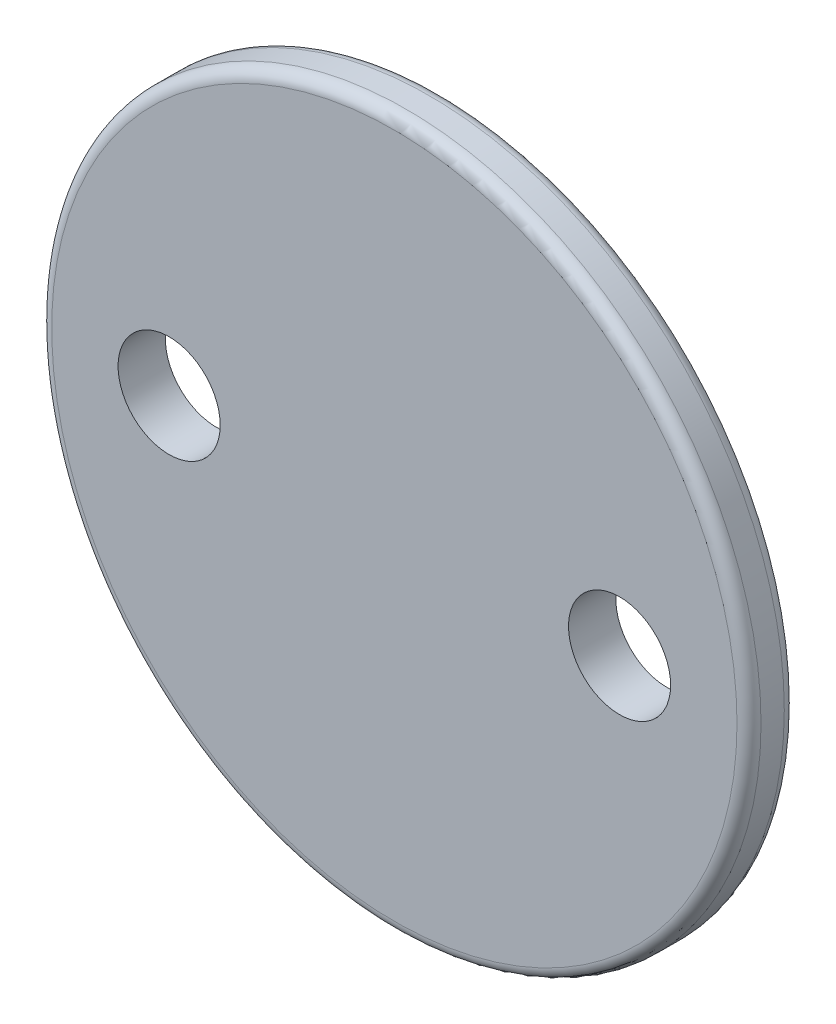
ISO-10303-21;
HEADER;
FILE_DESCRIPTION(('STEP AP214'),'2;1');
FILE_NAME('part.step','',(''),(''),'','','');
FILE_SCHEMA(('AUTOMOTIVE_DESIGN { 1 0 10303 214 1 1 1 1 }'));
ENDSEC;
DATA;
#1=APPLICATION_CONTEXT('core data for automotive mechanical design processes');
#2=APPLICATION_PROTOCOL_DEFINITION('international standard','automotive_design',2000,#1);
#3=PRODUCT_CONTEXT('',#1,'mechanical');
#4=PRODUCT('Part','Part','',(#3));
#5=PRODUCT_RELATED_PRODUCT_CATEGORY('part','',(#4));
#6=PRODUCT_DEFINITION_FORMATION('','',#4);
#7=PRODUCT_DEFINITION_CONTEXT('part definition',#1,'design');
#8=PRODUCT_DEFINITION('design','',#6,#7);
#9=PRODUCT_DEFINITION_SHAPE('','',#8);
#10=(LENGTH_UNIT() NAMED_UNIT(*) SI_UNIT(.MILLI.,.METRE.));
#11=(NAMED_UNIT(*) PLANE_ANGLE_UNIT() SI_UNIT($,.RADIAN.));
#12=(NAMED_UNIT(*) SI_UNIT($,.STERADIAN.) SOLID_ANGLE_UNIT());
#13=UNCERTAINTY_MEASURE_WITH_UNIT(LENGTH_MEASURE(1.E-05),#10,'distance_accuracy_value','');
#14=(GEOMETRIC_REPRESENTATION_CONTEXT(3) GLOBAL_UNCERTAINTY_ASSIGNED_CONTEXT((#13)) GLOBAL_UNIT_ASSIGNED_CONTEXT((#10,
#11,#12)) REPRESENTATION_CONTEXT('',''));
#15=CARTESIAN_POINT('',(0.,0.,0.));
#16=DIRECTION('',(0.,0.,1.));
#17=DIRECTION('',(1.,0.,0.));
#18=AXIS2_PLACEMENT_3D('',#15,#16,#17);
#19=CARTESIAN_POINT('',(0.,0.,0.));
#20=DIRECTION('',(0.,0.,1.));
#21=DIRECTION('',(1.,0.,0.));
#22=AXIS2_PLACEMENT_3D('',#19,#20,#21);
#23=PLANE('',#22);
#24=CARTESIAN_POINT('',(0.,0.,0.));
#25=DIRECTION('',(0.,0.,1.));
#26=DIRECTION('',(1.,0.,0.));
#27=AXIS2_PLACEMENT_3D('',#24,#25,#26);
#28=CIRCLE('',#27,4.5);
#29=CARTESIAN_POINT('',(4.5,0.,0.));
#30=VERTEX_POINT('',#29);
#31=EDGE_CURVE('E72',#30,#30,#28,.T.);
#32=ORIENTED_EDGE('',*,*,#31,.F.);
#33=EDGE_LOOP('',(#32));
#34=FACE_BOUND('',#33,.T.);
#35=CARTESIAN_POINT('',(0.,0.,0.));
#36=DIRECTION('',(0.,0.,1.));
#37=DIRECTION('',(1.,0.,0.));
#38=AXIS2_PLACEMENT_3D('',#35,#36,#37);
#39=CIRCLE('',#38,2.5);
#40=CARTESIAN_POINT('',(2.5,0.,0.));
#41=VERTEX_POINT('',#40);
#42=EDGE_CURVE('E76',#41,#41,#39,.T.);
#43=ORIENTED_EDGE('',*,*,#42,.T.);
#44=EDGE_LOOP('',(#43));
#45=FACE_BOUND('',#44,.T.);
#46=ADVANCED_FACE('F37',(#34,#45),#23,.F.);
#47=CARTESIAN_POINT('',(0.,0.,2.5));
#48=DIRECTION('',(0.,0.,-1.));
#49=DIRECTION('',(-1.,0.,0.));
#50=AXIS2_PLACEMENT_3D('',#47,#48,#49);
#51=CYLINDRICAL_SURFACE('',#50,4.5);
#52=CARTESIAN_POINT('',(0.,0.,2.5));
#53=DIRECTION('',(0.,0.,1.));
#54=DIRECTION('',(1.,0.,0.));
#55=AXIS2_PLACEMENT_3D('',#52,#53,#54);
#56=CIRCLE('',#55,4.5);
#57=CARTESIAN_POINT('',(4.5,0.,2.5));
#58=VERTEX_POINT('',#57);
#59=EDGE_CURVE('E61',#58,#58,#56,.T.);
#60=ORIENTED_EDGE('',*,*,#59,.F.);
#61=EDGE_LOOP('',(#60));
#62=FACE_BOUND('',#61,.T.);
#63=ORIENTED_EDGE('',*,*,#31,.T.);
#64=EDGE_LOOP('',(#63));
#65=FACE_BOUND('',#64,.T.);
#66=ADVANCED_FACE('F113',(#62,#65),#51,.T.);
#67=CARTESIAN_POINT('',(0.,0.,2.5));
#68=DIRECTION('',(0.,0.,-1.));
#69=DIRECTION('',(-1.,0.,0.));
#70=AXIS2_PLACEMENT_3D('',#67,#68,#69);
#71=CYLINDRICAL_SURFACE('',#70,2.5);
#72=CARTESIAN_POINT('',(0.,0.,2.5));
#73=DIRECTION('',(0.,0.,1.));
#74=DIRECTION('',(1.,0.,0.));
#75=AXIS2_PLACEMENT_3D('',#72,#73,#74);
#76=CIRCLE('',#75,2.5);
#77=CARTESIAN_POINT('',(2.5,0.,2.5));
#78=VERTEX_POINT('',#77);
#79=EDGE_CURVE('E83',#78,#78,#76,.T.);
#80=ORIENTED_EDGE('',*,*,#79,.T.);
#81=EDGE_LOOP('',(#80));
#82=FACE_BOUND('',#81,.T.);
#83=ORIENTED_EDGE('',*,*,#42,.F.);
#84=EDGE_LOOP('',(#83));
#85=FACE_BOUND('',#84,.T.);
#86=ADVANCED_FACE('F119',(#82,#85),#71,.F.);
#87=CARTESIAN_POINT('',(0.,0.,2.5));
#88=DIRECTION('',(0.,0.,1.));
#89=DIRECTION('',(1.,0.,0.));
#90=AXIS2_PLACEMENT_3D('',#87,#88,#89);
#91=PLANE('',#90);
#92=ORIENTED_EDGE('',*,*,#79,.F.);
#93=EDGE_LOOP('',(#92));
#94=FACE_BOUND('',#93,.T.);
#95=ADVANCED_FACE('F107',(#94),#91,.F.);
#96=CARTESIAN_POINT('',(0.,0.,4.5));
#97=DIRECTION('',(0.,0.,-1.));
#98=DIRECTION('',(-1.,0.,0.));
#99=AXIS2_PLACEMENT_3D('',#96,#97,#98);
#100=CYLINDRICAL_SURFACE('',#99,15.);
#101=CARTESIAN_POINT('',(0.,0.,3.008));
#102=DIRECTION('',(0.,0.,1.));
#103=DIRECTION('',(1.,0.,0.));
#104=AXIS2_PLACEMENT_3D('',#101,#102,#103);
#105=CIRCLE('',#104,15.);
#106=CARTESIAN_POINT('',(15.,0.,3.008));
#107=VERTEX_POINT('',#106);
#108=EDGE_CURVE('E50',#107,#107,#105,.T.);
#109=ORIENTED_EDGE('',*,*,#108,.T.);
#110=EDGE_LOOP('',(#109));
#111=FACE_BOUND('',#110,.T.);
#112=CARTESIAN_POINT('',(0.,0.,3.992));
#113=DIRECTION('',(0.,0.,1.));
#114=DIRECTION('',(1.,0.,0.));
#115=AXIS2_PLACEMENT_3D('',#112,#113,#114);
#116=CIRCLE('',#115,15.);
#117=CARTESIAN_POINT('',(15.,0.,3.992));
#118=VERTEX_POINT('',#117);
#119=EDGE_CURVE('E55',#118,#118,#116,.F.);
#120=ORIENTED_EDGE('',*,*,#119,.T.);
#121=EDGE_LOOP('',(#120));
#122=FACE_BOUND('',#121,.T.);
#123=ADVANCED_FACE('F100',(#111,#122),#100,.T.);
#124=CARTESIAN_POINT('',(0.,0.,4.5));
#125=DIRECTION('',(0.,0.,1.));
#126=DIRECTION('',(1.,0.,0.));
#127=AXIS2_PLACEMENT_3D('',#124,#125,#126);
#128=PLANE('',#127);
#129=CARTESIAN_POINT('',(0.,0.,4.5));
#130=DIRECTION('',(0.,0.,1.));
#131=DIRECTION('',(1.,0.,0.));
#132=AXIS2_PLACEMENT_3D('',#129,#130,#131);
#133=CIRCLE('',#132,14.492);
#134=CARTESIAN_POINT('',(14.492,0.,4.5));
#135=VERTEX_POINT('',#134);
#136=EDGE_CURVE('E10',#135,#135,#133,.T.);
#137=ORIENTED_EDGE('',*,*,#136,.T.);
#138=EDGE_LOOP('',(#137));
#139=FACE_BOUND('',#138,.T.);
#140=CARTESIAN_POINT('',(-9.525,0.,4.5));
#141=DIRECTION('',(0.,0.,1.));
#142=DIRECTION('',(1.,0.,0.));
#143=AXIS2_PLACEMENT_3D('',#140,#141,#142);
#144=CIRCLE('',#143,2.159);
#145=CARTESIAN_POINT('',(-7.366,0.,4.5));
#146=VERTEX_POINT('',#145);
#147=EDGE_CURVE('E66',#146,#146,#144,.T.);
#148=ORIENTED_EDGE('',*,*,#147,.F.);
#149=EDGE_LOOP('',(#148));
#150=FACE_BOUND('',#149,.T.);
#151=CARTESIAN_POINT('',(9.525,0.,4.5));
#152=DIRECTION('',(0.,0.,1.));
#153=DIRECTION('',(1.,0.,0.));
#154=AXIS2_PLACEMENT_3D('',#151,#152,#153);
#155=CIRCLE('',#154,2.159);
#156=CARTESIAN_POINT('',(11.684,0.,4.5));
#157=VERTEX_POINT('',#156);
#158=EDGE_CURVE('E67',#157,#157,#155,.T.);
#159=ORIENTED_EDGE('',*,*,#158,.F.);
#160=EDGE_LOOP('',(#159));
#161=FACE_BOUND('',#160,.T.);
#162=ADVANCED_FACE('F97',(#139,#150,#161),#128,.T.);
#163=CARTESIAN_POINT('',(0.,0.,2.5));
#164=DIRECTION('',(0.,0.,1.));
#165=DIRECTION('',(1.,0.,0.));
#166=AXIS2_PLACEMENT_3D('',#163,#164,#165);
#167=CIRCLE('',#166,14.492);
#168=CARTESIAN_POINT('',(14.492,0.,2.5));
#169=VERTEX_POINT('',#168);
#170=EDGE_CURVE('E45',#169,#169,#167,.F.);
#171=ORIENTED_EDGE('',*,*,#170,.T.);
#172=EDGE_LOOP('',(#171));
#173=FACE_BOUND('',#172,.T.);
#174=CARTESIAN_POINT('',(-9.525,0.,2.5));
#175=DIRECTION('',(0.,0.,1.));
#176=DIRECTION('',(1.,0.,0.));
#177=AXIS2_PLACEMENT_3D('',#174,#175,#176);
#178=CIRCLE('',#177,2.159);
#179=CARTESIAN_POINT('',(-7.366,0.,2.5));
#180=VERTEX_POINT('',#179);
#181=EDGE_CURVE('E62',#180,#180,#178,.T.);
#182=ORIENTED_EDGE('',*,*,#181,.T.);
#183=EDGE_LOOP('',(#182));
#184=FACE_BOUND('',#183,.T.);
#185=CARTESIAN_POINT('',(9.525,0.,2.5));
#186=DIRECTION('',(0.,0.,1.));
#187=DIRECTION('',(1.,0.,0.));
#188=AXIS2_PLACEMENT_3D('',#185,#186,#187);
#189=CIRCLE('',#188,2.159);
#190=CARTESIAN_POINT('',(11.684,0.,2.5));
#191=VERTEX_POINT('',#190);
#192=EDGE_CURVE('E68',#191,#191,#189,.T.);
#193=ORIENTED_EDGE('',*,*,#192,.T.);
#194=EDGE_LOOP('',(#193));
#195=FACE_BOUND('',#194,.T.);
#196=ORIENTED_EDGE('',*,*,#59,.T.);
#197=EDGE_LOOP('',(#196));
#198=FACE_BOUND('',#197,.T.);
#199=ADVANCED_FACE('F99',(#173,#184,#195,#198),#91,.F.);
#200=CARTESIAN_POINT('',(9.525,0.,0.));
#201=DIRECTION('',(0.,0.,1.));
#202=DIRECTION('',(1.,0.,0.));
#203=AXIS2_PLACEMENT_3D('',#200,#201,#202);
#204=CYLINDRICAL_SURFACE('',#203,2.159);
#205=ORIENTED_EDGE('',*,*,#158,.T.);
#206=EDGE_LOOP('',(#205));
#207=FACE_BOUND('',#206,.T.);
#208=ORIENTED_EDGE('',*,*,#192,.F.);
#209=EDGE_LOOP('',(#208));
#210=FACE_BOUND('',#209,.T.);
#211=ADVANCED_FACE('F94',(#207,#210),#204,.F.);
#212=CARTESIAN_POINT('',(-9.525,0.,0.));
#213=DIRECTION('',(0.,0.,1.));
#214=DIRECTION('',(1.,0.,0.));
#215=AXIS2_PLACEMENT_3D('',#212,#213,#214);
#216=CYLINDRICAL_SURFACE('',#215,2.159);
#217=ORIENTED_EDGE('',*,*,#147,.T.);
#218=EDGE_LOOP('',(#217));
#219=FACE_BOUND('',#218,.T.);
#220=ORIENTED_EDGE('',*,*,#181,.F.);
#221=EDGE_LOOP('',(#220));
#222=FACE_BOUND('',#221,.T.);
#223=ADVANCED_FACE('F127',(#219,#222),#216,.F.);
#224=CARTESIAN_POINT('',(0.,0.,3.008));
#225=DIRECTION('',(0.,0.,1.));
#226=DIRECTION('',(1.,0.,0.));
#227=AXIS2_PLACEMENT_3D('',#224,#225,#226);
#228=TOROIDAL_SURFACE('',#227,14.492,0.508);
#229=ORIENTED_EDGE('',*,*,#170,.F.);
#230=EDGE_LOOP('',(#229));
#231=FACE_BOUND('',#230,.T.);
#232=ORIENTED_EDGE('',*,*,#108,.F.);
#233=EDGE_LOOP('',(#232));
#234=FACE_BOUND('',#233,.T.);
#235=ADVANCED_FACE('F125',(#231,#234),#228,.T.);
#236=CARTESIAN_POINT('',(0.,0.,3.992));
#237=DIRECTION('',(0.,0.,1.));
#238=DIRECTION('',(1.,0.,0.));
#239=AXIS2_PLACEMENT_3D('',#236,#237,#238);
#240=TOROIDAL_SURFACE('',#239,14.492,0.508);
#241=ORIENTED_EDGE('',*,*,#119,.F.);
#242=EDGE_LOOP('',(#241));
#243=FACE_BOUND('',#242,.T.);
#244=ORIENTED_EDGE('',*,*,#136,.F.);
#245=EDGE_LOOP('',(#244));
#246=FACE_BOUND('',#245,.T.);
#247=ADVANCED_FACE('F39',(#243,#246),#240,.T.);
#248=CLOSED_SHELL('',(#46,#66,#86,#95,#123,#162,#199,#211,#223,#235,#247));
#249=MANIFOLD_SOLID_BREP('B2',#248);
#250=ADVANCED_BREP_SHAPE_REPRESENTATION('',(#18,#249),#14);
#251=SHAPE_DEFINITION_REPRESENTATION(#9,#250);
ENDSEC;
END-ISO-10303-21;
